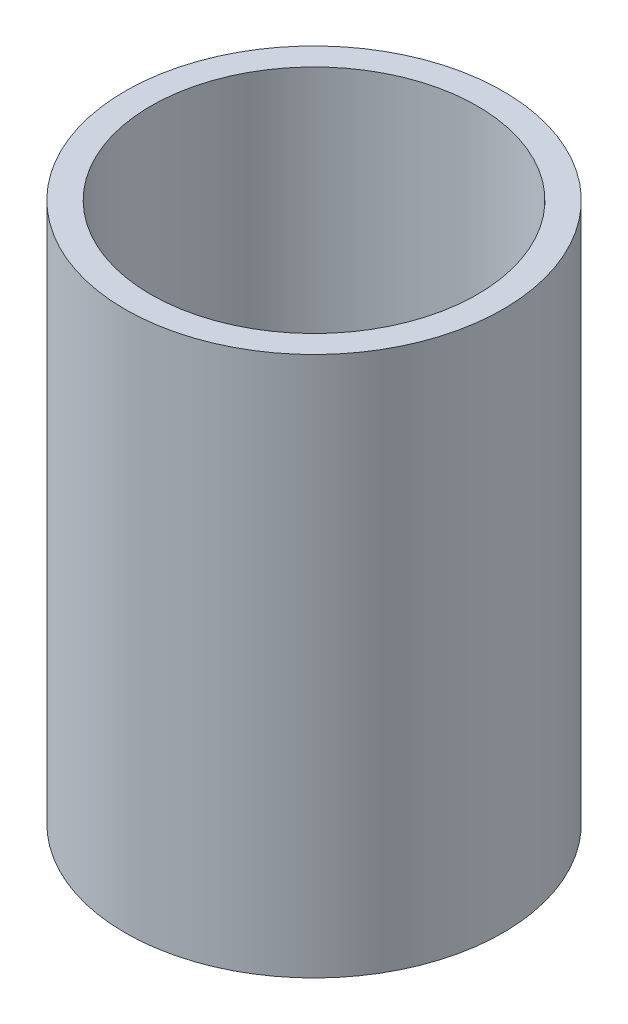
ISO-10303-21;
HEADER;
FILE_DESCRIPTION(('STEP AP214'),'2;1');
FILE_NAME('part.step','',(''),(''),'','','');
FILE_SCHEMA(('AUTOMOTIVE_DESIGN { 1 0 10303 214 1 1 1 1 }'));
ENDSEC;
DATA;
#1=APPLICATION_CONTEXT('core data for automotive mechanical design processes');
#2=APPLICATION_PROTOCOL_DEFINITION('international standard','automotive_design',2000,#1);
#3=PRODUCT_CONTEXT('',#1,'mechanical');
#4=PRODUCT('Part','Part','',(#3));
#5=PRODUCT_RELATED_PRODUCT_CATEGORY('part','',(#4));
#6=PRODUCT_DEFINITION_FORMATION('','',#4);
#7=PRODUCT_DEFINITION_CONTEXT('part definition',#1,'design');
#8=PRODUCT_DEFINITION('design','',#6,#7);
#9=PRODUCT_DEFINITION_SHAPE('','',#8);
#10=(LENGTH_UNIT() NAMED_UNIT(*) SI_UNIT(.MILLI.,.METRE.));
#11=(NAMED_UNIT(*) PLANE_ANGLE_UNIT() SI_UNIT($,.RADIAN.));
#12=(NAMED_UNIT(*) SI_UNIT($,.STERADIAN.) SOLID_ANGLE_UNIT());
#13=UNCERTAINTY_MEASURE_WITH_UNIT(LENGTH_MEASURE(1.E-05),#10,'distance_accuracy_value','');
#14=(GEOMETRIC_REPRESENTATION_CONTEXT(3) GLOBAL_UNCERTAINTY_ASSIGNED_CONTEXT((#13)) GLOBAL_UNIT_ASSIGNED_CONTEXT((#10,
#11,#12)) REPRESENTATION_CONTEXT('',''));
#15=CARTESIAN_POINT('',(0.,0.,0.));
#16=DIRECTION('',(0.,0.,1.));
#17=DIRECTION('',(1.,0.,0.));
#18=AXIS2_PLACEMENT_3D('',#15,#16,#17);
#19=CARTESIAN_POINT('',(0.,55.,0.));
#20=DIRECTION('',(0.,1.,0.));
#21=DIRECTION('',(0.,0.,1.));
#22=AXIS2_PLACEMENT_3D('',#19,#20,#21);
#23=CYLINDRICAL_SURFACE('',#22,46.6725);
#24=CARTESIAN_POINT('',(0.,-87.732365567385,0.));
#25=DIRECTION('',(0.,1.,0.));
#26=DIRECTION('',(0.,0.,1.));
#27=AXIS2_PLACEMENT_3D('',#24,#25,#26);
#28=CIRCLE('',#27,46.6725);
#29=CARTESIAN_POINT('',(0.,-87.732365567385,46.6725));
#30=VERTEX_POINT('',#29);
#31=EDGE_CURVE('E10',#30,#30,#28,.T.);
#32=ORIENTED_EDGE('',*,*,#31,.T.);
#33=EDGE_LOOP('',(#32));
#34=FACE_BOUND('',#33,.T.);
#35=CARTESIAN_POINT('',(0.,45.6176344326149,0.));
#36=DIRECTION('',(0.,1.,0.));
#37=DIRECTION('',(0.,0.,1.));
#38=AXIS2_PLACEMENT_3D('',#35,#36,#37);
#39=CIRCLE('',#38,46.6725);
#40=CARTESIAN_POINT('',(0.,45.6176344326149,46.6725));
#41=VERTEX_POINT('',#40);
#42=EDGE_CURVE('E45',#41,#41,#39,.T.);
#43=ORIENTED_EDGE('',*,*,#42,.F.);
#44=EDGE_LOOP('',(#43));
#45=FACE_BOUND('',#44,.T.);
#46=ADVANCED_FACE('F31',(#34,#45),#23,.T.);
#47=CARTESIAN_POINT('',(-46.6725,-87.7323655673851,0.));
#48=DIRECTION('',(0.,-1.,0.));
#49=DIRECTION('',(0.,0.,-1.));
#50=AXIS2_PLACEMENT_3D('',#47,#48,#49);
#51=PLANE('',#50);
#52=CARTESIAN_POINT('',(0.,-87.732365567385,0.));
#53=DIRECTION('',(0.,1.,0.));
#54=DIRECTION('',(0.,0.,1.));
#55=AXIS2_PLACEMENT_3D('',#52,#53,#54);
#56=CIRCLE('',#55,40.3225);
#57=CARTESIAN_POINT('',(0.,-87.732365567385,40.3225));
#58=VERTEX_POINT('',#57);
#59=EDGE_CURVE('E37',#58,#58,#56,.T.);
#60=ORIENTED_EDGE('',*,*,#59,.T.);
#61=EDGE_LOOP('',(#60));
#62=FACE_BOUND('',#61,.T.);
#63=ORIENTED_EDGE('',*,*,#31,.F.);
#64=EDGE_LOOP('',(#63));
#65=FACE_BOUND('',#64,.T.);
#66=ADVANCED_FACE('F55',(#62,#65),#51,.T.);
#67=CARTESIAN_POINT('',(0.,55.,0.));
#68=DIRECTION('',(0.,1.,0.));
#69=DIRECTION('',(0.,0.,1.));
#70=AXIS2_PLACEMENT_3D('',#67,#68,#69);
#71=CYLINDRICAL_SURFACE('',#70,40.3225);
#72=CARTESIAN_POINT('',(0.,45.6176344326149,0.));
#73=DIRECTION('',(0.,1.,0.));
#74=DIRECTION('',(0.,0.,1.));
#75=AXIS2_PLACEMENT_3D('',#72,#73,#74);
#76=CIRCLE('',#75,40.3225);
#77=CARTESIAN_POINT('',(0.,45.6176344326149,40.3225));
#78=VERTEX_POINT('',#77);
#79=EDGE_CURVE('E41',#78,#78,#76,.T.);
#80=ORIENTED_EDGE('',*,*,#79,.T.);
#81=EDGE_LOOP('',(#80));
#82=FACE_BOUND('',#81,.T.);
#83=ORIENTED_EDGE('',*,*,#59,.F.);
#84=EDGE_LOOP('',(#83));
#85=FACE_BOUND('',#84,.T.);
#86=ADVANCED_FACE('F59',(#82,#85),#71,.F.);
#87=CARTESIAN_POINT('',(-46.6725,45.6176344326149,0.));
#88=DIRECTION('',(0.,1.,0.));
#89=DIRECTION('',(0.,0.,1.));
#90=AXIS2_PLACEMENT_3D('',#87,#88,#89);
#91=PLANE('',#90);
#92=ORIENTED_EDGE('',*,*,#42,.T.);
#93=EDGE_LOOP('',(#92));
#94=FACE_BOUND('',#93,.T.);
#95=ORIENTED_EDGE('',*,*,#79,.F.);
#96=EDGE_LOOP('',(#95));
#97=FACE_BOUND('',#96,.T.);
#98=ADVANCED_FACE('F51',(#94,#97),#91,.T.);
#99=CLOSED_SHELL('',(#46,#66,#86,#98));
#100=MANIFOLD_SOLID_BREP('B2',#99);
#101=ADVANCED_BREP_SHAPE_REPRESENTATION('',(#18,#100),#14);
#102=SHAPE_DEFINITION_REPRESENTATION(#9,#101);
ENDSEC;
END-ISO-10303-21;
